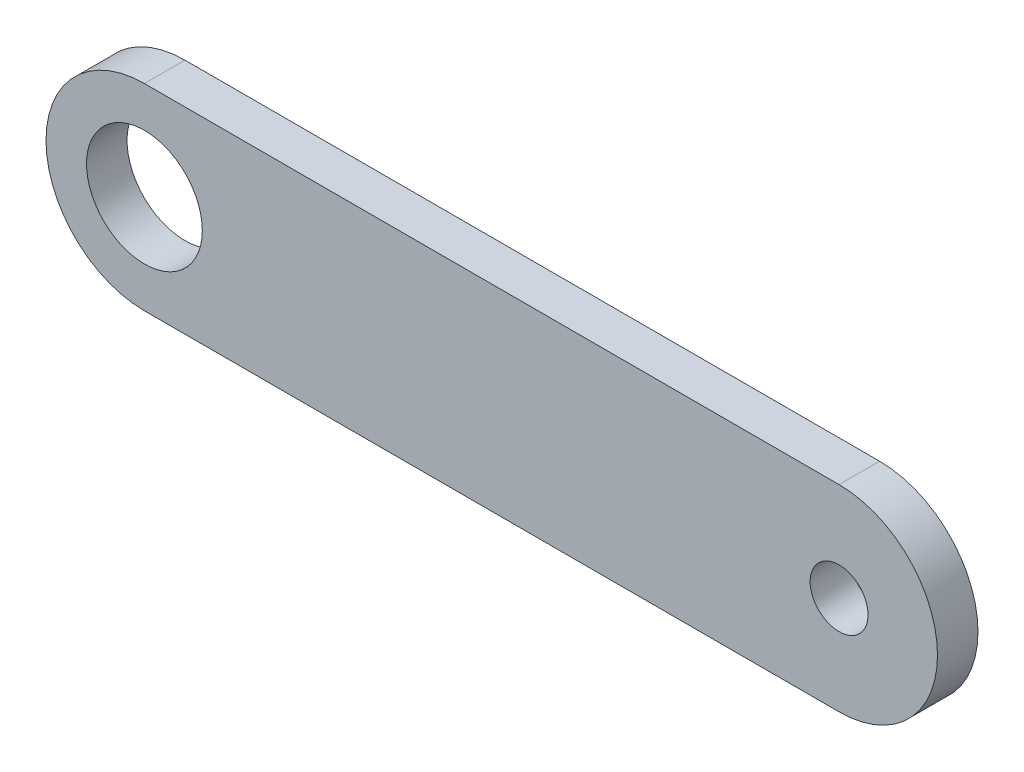
ISO-10303-21;
HEADER;
FILE_DESCRIPTION(('STEP AP214'),'2;1');
FILE_NAME('part.step','',(''),(''),'','','');
FILE_SCHEMA(('AUTOMOTIVE_DESIGN { 1 0 10303 214 1 1 1 1 }'));
ENDSEC;
DATA;
#1=APPLICATION_CONTEXT('core data for automotive mechanical design processes');
#2=APPLICATION_PROTOCOL_DEFINITION('international standard','automotive_design',2000,#1);
#3=PRODUCT_CONTEXT('',#1,'mechanical');
#4=PRODUCT('Part','Part','',(#3));
#5=PRODUCT_RELATED_PRODUCT_CATEGORY('part','',(#4));
#6=PRODUCT_DEFINITION_FORMATION('','',#4);
#7=PRODUCT_DEFINITION_CONTEXT('part definition',#1,'design');
#8=PRODUCT_DEFINITION('design','',#6,#7);
#9=PRODUCT_DEFINITION_SHAPE('','',#8);
#10=(LENGTH_UNIT() NAMED_UNIT(*) SI_UNIT(.MILLI.,.METRE.));
#11=(NAMED_UNIT(*) PLANE_ANGLE_UNIT() SI_UNIT($,.RADIAN.));
#12=(NAMED_UNIT(*) SI_UNIT($,.STERADIAN.) SOLID_ANGLE_UNIT());
#13=UNCERTAINTY_MEASURE_WITH_UNIT(LENGTH_MEASURE(1.E-05),#10,'distance_accuracy_value','');
#14=(GEOMETRIC_REPRESENTATION_CONTEXT(3) GLOBAL_UNCERTAINTY_ASSIGNED_CONTEXT((#13)) GLOBAL_UNIT_ASSIGNED_CONTEXT((#10,
#11,#12)) REPRESENTATION_CONTEXT('',''));
#15=CARTESIAN_POINT('',(0.,0.,0.));
#16=DIRECTION('',(0.,0.,1.));
#17=DIRECTION('',(1.,0.,0.));
#18=AXIS2_PLACEMENT_3D('',#15,#16,#17);
#19=CARTESIAN_POINT('',(30.,0.,3.5));
#20=DIRECTION('',(0.,0.,-1.));
#21=DIRECTION('',(-1.,0.,0.));
#22=AXIS2_PLACEMENT_3D('',#19,#20,#21);
#23=PLANE('',#22);
#24=CARTESIAN_POINT('',(30.,0.,3.5));
#25=DIRECTION('',(0.,0.,1.));
#26=DIRECTION('',(-1.,0.,0.));
#27=AXIS2_PLACEMENT_3D('',#24,#25,#26);
#28=CIRCLE('',#27,8.5);
#29=CARTESIAN_POINT('',(30.,-8.5,3.5));
#30=VERTEX_POINT('',#29);
#31=CARTESIAN_POINT('',(30.,8.5,3.5));
#32=VERTEX_POINT('',#31);
#33=EDGE_CURVE('E87',#30,#32,#28,.T.);
#34=ORIENTED_EDGE('',*,*,#33,.T.);
#35=DIRECTION('',(-1.,0.,0.));
#36=VECTOR('',#35,1.);
#37=CARTESIAN_POINT('',(30.,8.5,3.5));
#38=LINE('',#37,#36);
#39=CARTESIAN_POINT('',(-30.,8.49999999999999,3.5));
#40=VERTEX_POINT('',#39);
#41=EDGE_CURVE('E82',#32,#40,#38,.T.);
#42=ORIENTED_EDGE('',*,*,#41,.T.);
#43=CARTESIAN_POINT('',(-30.,0.,3.5));
#44=DIRECTION('',(0.,0.,1.));
#45=DIRECTION('',(1.,0.,0.));
#46=AXIS2_PLACEMENT_3D('',#43,#44,#45);
#47=CIRCLE('',#46,8.5);
#48=CARTESIAN_POINT('',(-30.,-8.50000000000001,3.5));
#49=VERTEX_POINT('',#48);
#50=EDGE_CURVE('E85',#40,#49,#47,.T.);
#51=ORIENTED_EDGE('',*,*,#50,.T.);
#52=DIRECTION('',(1.,0.,0.));
#53=VECTOR('',#52,1.);
#54=CARTESIAN_POINT('',(30.,-8.5,3.5));
#55=LINE('',#54,#53);
#56=EDGE_CURVE('E52',#49,#30,#55,.T.);
#57=ORIENTED_EDGE('',*,*,#56,.T.);
#58=EDGE_LOOP('',(#34,#42,#51,#57));
#59=FACE_BOUND('',#58,.T.);
#60=CARTESIAN_POINT('',(30.,0.,3.5));
#61=DIRECTION('',(0.,0.,1.));
#62=DIRECTION('',(1.,0.,0.));
#63=AXIS2_PLACEMENT_3D('',#60,#61,#62);
#64=CIRCLE('',#63,2.5);
#65=CARTESIAN_POINT('',(32.5,0.,3.5));
#66=VERTEX_POINT('',#65);
#67=EDGE_CURVE('E102',#66,#66,#64,.T.);
#68=ORIENTED_EDGE('',*,*,#67,.F.);
#69=EDGE_LOOP('',(#68));
#70=FACE_BOUND('',#69,.T.);
#71=CARTESIAN_POINT('',(-30.,0.,3.5));
#72=DIRECTION('',(0.,0.,1.));
#73=DIRECTION('',(1.,0.,0.));
#74=AXIS2_PLACEMENT_3D('',#71,#72,#73);
#75=CIRCLE('',#74,5.);
#76=CARTESIAN_POINT('',(-25.,0.,3.5));
#77=VERTEX_POINT('',#76);
#78=EDGE_CURVE('E117',#77,#77,#75,.T.);
#79=ORIENTED_EDGE('',*,*,#78,.F.);
#80=EDGE_LOOP('',(#79));
#81=FACE_BOUND('',#80,.T.);
#82=ADVANCED_FACE('F35',(#59,#70,#81),#23,.F.);
#83=CARTESIAN_POINT('',(30.,0.,0.));
#84=DIRECTION('',(0.,0.,-1.));
#85=DIRECTION('',(-1.,0.,0.));
#86=AXIS2_PLACEMENT_3D('',#83,#84,#85);
#87=PLANE('',#86);
#88=CARTESIAN_POINT('',(30.,0.,0.));
#89=DIRECTION('',(0.,0.,1.));
#90=DIRECTION('',(1.,0.,0.));
#91=AXIS2_PLACEMENT_3D('',#88,#89,#90);
#92=CIRCLE('',#91,2.5);
#93=CARTESIAN_POINT('',(32.5,0.,0.));
#94=VERTEX_POINT('',#93);
#95=EDGE_CURVE('E114',#94,#94,#92,.T.);
#96=ORIENTED_EDGE('',*,*,#95,.T.);
#97=EDGE_LOOP('',(#96));
#98=FACE_BOUND('',#97,.T.);
#99=CARTESIAN_POINT('',(30.,0.,0.));
#100=DIRECTION('',(0.,0.,1.));
#101=DIRECTION('',(-1.,0.,0.));
#102=AXIS2_PLACEMENT_3D('',#99,#100,#101);
#103=CIRCLE('',#102,8.5);
#104=CARTESIAN_POINT('',(30.,-8.5,0.));
#105=VERTEX_POINT('',#104);
#106=CARTESIAN_POINT('',(30.,8.5,0.));
#107=VERTEX_POINT('',#106);
#108=EDGE_CURVE('E99',#105,#107,#103,.T.);
#109=ORIENTED_EDGE('',*,*,#108,.F.);
#110=DIRECTION('',(1.,0.,0.));
#111=VECTOR('',#110,1.);
#112=CARTESIAN_POINT('',(30.,-8.5,0.));
#113=LINE('',#112,#111);
#114=CARTESIAN_POINT('',(-30.,-8.50000000000001,0.));
#115=VERTEX_POINT('',#114);
#116=EDGE_CURVE('E75',#115,#105,#113,.T.);
#117=ORIENTED_EDGE('',*,*,#116,.F.);
#118=CARTESIAN_POINT('',(-30.,0.,0.));
#119=DIRECTION('',(0.,0.,1.));
#120=DIRECTION('',(1.,0.,0.));
#121=AXIS2_PLACEMENT_3D('',#118,#119,#120);
#122=CIRCLE('',#121,8.5);
#123=CARTESIAN_POINT('',(-30.,8.49999999999999,0.));
#124=VERTEX_POINT('',#123);
#125=EDGE_CURVE('E69',#124,#115,#122,.T.);
#126=ORIENTED_EDGE('',*,*,#125,.F.);
#127=DIRECTION('',(-1.,0.,0.));
#128=VECTOR('',#127,1.);
#129=CARTESIAN_POINT('',(30.,8.5,0.));
#130=LINE('',#129,#128);
#131=EDGE_CURVE('E91',#107,#124,#130,.T.);
#132=ORIENTED_EDGE('',*,*,#131,.F.);
#133=EDGE_LOOP('',(#109,#117,#126,#132));
#134=FACE_BOUND('',#133,.T.);
#135=CARTESIAN_POINT('',(-30.,0.,0.));
#136=DIRECTION('',(0.,0.,1.));
#137=DIRECTION('',(1.,0.,0.));
#138=AXIS2_PLACEMENT_3D('',#135,#136,#137);
#139=CIRCLE('',#138,5.);
#140=CARTESIAN_POINT('',(-25.,0.,0.));
#141=VERTEX_POINT('',#140);
#142=EDGE_CURVE('E120',#141,#141,#139,.T.);
#143=ORIENTED_EDGE('',*,*,#142,.T.);
#144=EDGE_LOOP('',(#143));
#145=FACE_BOUND('',#144,.T.);
#146=ADVANCED_FACE('F110',(#98,#134,#145),#87,.T.);
#147=CARTESIAN_POINT('',(30.,0.,3.5));
#148=DIRECTION('',(0.,0.,-1.));
#149=DIRECTION('',(-1.,0.,0.));
#150=AXIS2_PLACEMENT_3D('',#147,#148,#149);
#151=CYLINDRICAL_SURFACE('',#150,8.5);
#152=ORIENTED_EDGE('',*,*,#108,.T.);
#153=DIRECTION('',(0.,0.,-1.));
#154=VECTOR('',#153,1.);
#155=CARTESIAN_POINT('',(30.,8.5,3.5));
#156=LINE('',#155,#154);
#157=EDGE_CURVE('E11',#32,#107,#156,.T.);
#158=ORIENTED_EDGE('',*,*,#157,.F.);
#159=ORIENTED_EDGE('',*,*,#33,.F.);
#160=DIRECTION('',(0.,0.,-1.));
#161=VECTOR('',#160,1.);
#162=CARTESIAN_POINT('',(30.,-8.5,3.5));
#163=LINE('',#162,#161);
#164=EDGE_CURVE('E95',#30,#105,#163,.T.);
#165=ORIENTED_EDGE('',*,*,#164,.T.);
#166=EDGE_LOOP('',(#152,#158,#159,#165));
#167=FACE_BOUND('',#166,.T.);
#168=ADVANCED_FACE('F37',(#167),#151,.T.);
#169=CARTESIAN_POINT('',(30.,8.5,3.5));
#170=DIRECTION('',(0.,-1.,0.));
#171=DIRECTION('',(1.,0.,0.));
#172=AXIS2_PLACEMENT_3D('',#169,#170,#171);
#173=PLANE('',#172);
#174=ORIENTED_EDGE('',*,*,#131,.T.);
#175=DIRECTION('',(0.,0.,-1.));
#176=VECTOR('',#175,1.);
#177=CARTESIAN_POINT('',(-30.,8.49999999999999,3.5));
#178=LINE('',#177,#176);
#179=EDGE_CURVE('E44',#40,#124,#178,.T.);
#180=ORIENTED_EDGE('',*,*,#179,.F.);
#181=ORIENTED_EDGE('',*,*,#41,.F.);
#182=ORIENTED_EDGE('',*,*,#157,.T.);
#183=EDGE_LOOP('',(#174,#180,#181,#182));
#184=FACE_BOUND('',#183,.T.);
#185=ADVANCED_FACE('F90',(#184),#173,.F.);
#186=CARTESIAN_POINT('',(-30.,0.,3.5));
#187=DIRECTION('',(0.,0.,-1.));
#188=DIRECTION('',(-1.,0.,0.));
#189=AXIS2_PLACEMENT_3D('',#186,#187,#188);
#190=CYLINDRICAL_SURFACE('',#189,8.5);
#191=ORIENTED_EDGE('',*,*,#125,.T.);
#192=DIRECTION('',(0.,0.,-1.));
#193=VECTOR('',#192,1.);
#194=CARTESIAN_POINT('',(-30.,-8.50000000000001,3.5));
#195=LINE('',#194,#193);
#196=EDGE_CURVE('E92',#49,#115,#195,.T.);
#197=ORIENTED_EDGE('',*,*,#196,.F.);
#198=ORIENTED_EDGE('',*,*,#50,.F.);
#199=ORIENTED_EDGE('',*,*,#179,.T.);
#200=EDGE_LOOP('',(#191,#197,#198,#199));
#201=FACE_BOUND('',#200,.T.);
#202=ADVANCED_FACE('F93',(#201),#190,.T.);
#203=CARTESIAN_POINT('',(30.,-8.5,3.5));
#204=DIRECTION('',(0.,1.,0.));
#205=DIRECTION('',(-1.,0.,0.));
#206=AXIS2_PLACEMENT_3D('',#203,#204,#205);
#207=PLANE('',#206);
#208=ORIENTED_EDGE('',*,*,#116,.T.);
#209=ORIENTED_EDGE('',*,*,#164,.F.);
#210=ORIENTED_EDGE('',*,*,#56,.F.);
#211=ORIENTED_EDGE('',*,*,#196,.T.);
#212=EDGE_LOOP('',(#208,#209,#210,#211));
#213=FACE_BOUND('',#212,.T.);
#214=ADVANCED_FACE('F107',(#213),#207,.F.);
#215=CARTESIAN_POINT('',(30.,0.,3.5));
#216=DIRECTION('',(0.,0.,-1.));
#217=DIRECTION('',(-1.,0.,0.));
#218=AXIS2_PLACEMENT_3D('',#215,#216,#217);
#219=CYLINDRICAL_SURFACE('',#218,2.5);
#220=ORIENTED_EDGE('',*,*,#67,.T.);
#221=EDGE_LOOP('',(#220));
#222=FACE_BOUND('',#221,.T.);
#223=ORIENTED_EDGE('',*,*,#95,.F.);
#224=EDGE_LOOP('',(#223));
#225=FACE_BOUND('',#224,.T.);
#226=ADVANCED_FACE('F137',(#222,#225),#219,.F.);
#227=CARTESIAN_POINT('',(-30.,0.,3.5));
#228=DIRECTION('',(0.,0.,-1.));
#229=DIRECTION('',(-1.,0.,0.));
#230=AXIS2_PLACEMENT_3D('',#227,#228,#229);
#231=CYLINDRICAL_SURFACE('',#230,5.);
#232=ORIENTED_EDGE('',*,*,#78,.T.);
#233=EDGE_LOOP('',(#232));
#234=FACE_BOUND('',#233,.T.);
#235=ORIENTED_EDGE('',*,*,#142,.F.);
#236=EDGE_LOOP('',(#235));
#237=FACE_BOUND('',#236,.T.);
#238=ADVANCED_FACE('F126',(#234,#237),#231,.F.);
#239=CLOSED_SHELL('',(#82,#146,#168,#185,#202,#214,#226,#238));
#240=MANIFOLD_SOLID_BREP('B2',#239);
#241=ADVANCED_BREP_SHAPE_REPRESENTATION('',(#18,#240),#14);
#242=SHAPE_DEFINITION_REPRESENTATION(#9,#241);
ENDSEC;
END-ISO-10303-21;
